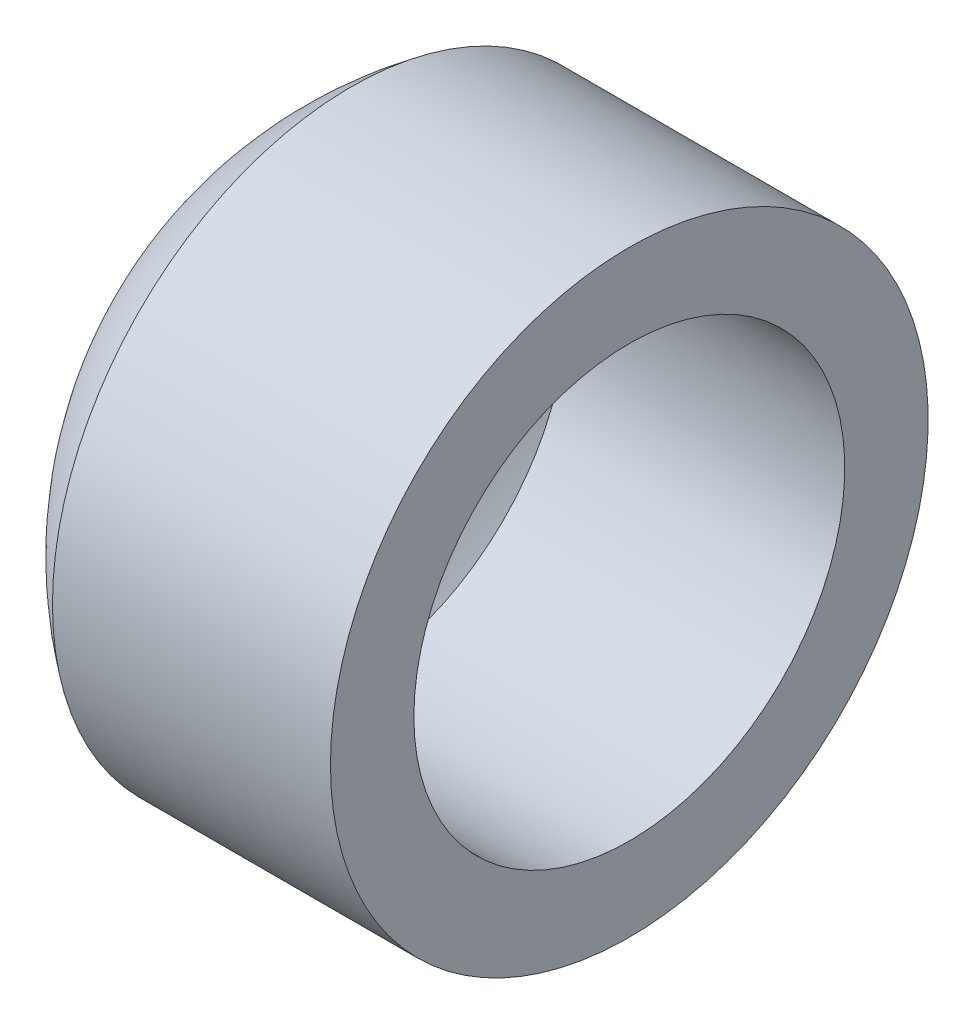
ISO-10303-21;
HEADER;
FILE_DESCRIPTION(('STEP AP214'),'2;1');
FILE_NAME('part.step','',(''),(''),'','','');
FILE_SCHEMA(('AUTOMOTIVE_DESIGN { 1 0 10303 214 1 1 1 1 }'));
ENDSEC;
DATA;
#1=APPLICATION_CONTEXT('core data for automotive mechanical design processes');
#2=APPLICATION_PROTOCOL_DEFINITION('international standard','automotive_design',2000,#1);
#3=PRODUCT_CONTEXT('',#1,'mechanical');
#4=PRODUCT('Part','Part','',(#3));
#5=PRODUCT_RELATED_PRODUCT_CATEGORY('part','',(#4));
#6=PRODUCT_DEFINITION_FORMATION('','',#4);
#7=PRODUCT_DEFINITION_CONTEXT('part definition',#1,'design');
#8=PRODUCT_DEFINITION('design','',#6,#7);
#9=PRODUCT_DEFINITION_SHAPE('','',#8);
#10=(LENGTH_UNIT() NAMED_UNIT(*) SI_UNIT(.MILLI.,.METRE.));
#11=(NAMED_UNIT(*) PLANE_ANGLE_UNIT() SI_UNIT($,.RADIAN.));
#12=(NAMED_UNIT(*) SI_UNIT($,.STERADIAN.) SOLID_ANGLE_UNIT());
#13=UNCERTAINTY_MEASURE_WITH_UNIT(LENGTH_MEASURE(1.E-05),#10,'distance_accuracy_value','');
#14=(GEOMETRIC_REPRESENTATION_CONTEXT(3) GLOBAL_UNCERTAINTY_ASSIGNED_CONTEXT((#13)) GLOBAL_UNIT_ASSIGNED_CONTEXT((#10,
#11,#12)) REPRESENTATION_CONTEXT('',''));
#15=CARTESIAN_POINT('',(0.,0.,0.));
#16=DIRECTION('',(0.,0.,1.));
#17=DIRECTION('',(1.,0.,0.));
#18=AXIS2_PLACEMENT_3D('',#15,#16,#17);
#19=CARTESIAN_POINT('',(-4.4886363636,0.,0.));
#20=DIRECTION('',(-1.,0.,0.));
#21=DIRECTION('',(0.,0.,1.));
#22=AXIS2_PLACEMENT_3D('',#19,#20,#21);
#23=SPHERICAL_SURFACE('',#22,26.5113636364);
#24=CARTESIAN_POINT('',(-20.0000000000258,0.,0.));
#25=DIRECTION('',(1.,0.,0.));
#26=DIRECTION('',(0.,0.,1.));
#27=AXIS2_PLACEMENT_3D('',#24,#25,#26);
#28=CIRCLE('',#27,21.5);
#29=CARTESIAN_POINT('',(-20.,0.,21.5));
#30=VERTEX_POINT('',#29);
#31=EDGE_CURVE('E11',#30,#30,#28,.T.);
#32=ORIENTED_EDGE('',*,*,#31,.F.);
#33=EDGE_LOOP('',(#32));
#34=FACE_BOUND('',#33,.T.);
#35=ADVANCED_FACE('F16',(#34),#23,.T.);
#36=CARTESIAN_POINT('',(0.,0.,0.));
#37=DIRECTION('',(1.,0.,0.));
#38=DIRECTION('',(0.,0.,-1.));
#39=AXIS2_PLACEMENT_3D('',#36,#37,#38);
#40=PLANE('',#39);
#41=CARTESIAN_POINT('',(0.,0.,0.));
#42=DIRECTION('',(1.,0.,0.));
#43=DIRECTION('',(0.,0.,1.));
#44=AXIS2_PLACEMENT_3D('',#41,#42,#43);
#45=CIRCLE('',#44,21.5);
#46=CARTESIAN_POINT('',(0.,0.,21.5));
#47=VERTEX_POINT('',#46);
#48=EDGE_CURVE('E26',#47,#47,#45,.T.);
#49=ORIENTED_EDGE('',*,*,#48,.T.);
#50=EDGE_LOOP('',(#49));
#51=FACE_BOUND('',#50,.T.);
#52=CARTESIAN_POINT('',(0.,0.,0.));
#53=DIRECTION('',(-1.,0.,0.));
#54=DIRECTION('',(0.,0.,1.));
#55=AXIS2_PLACEMENT_3D('',#52,#53,#54);
#56=CIRCLE('',#55,15.5);
#57=CARTESIAN_POINT('',(0.,0.,15.5));
#58=VERTEX_POINT('',#57);
#59=EDGE_CURVE('E40',#58,#58,#56,.T.);
#60=ORIENTED_EDGE('',*,*,#59,.T.);
#61=EDGE_LOOP('',(#60));
#62=FACE_BOUND('',#61,.T.);
#63=ADVANCED_FACE('F41',(#51,#62),#40,.T.);
#64=CARTESIAN_POINT('',(-10.,0.,0.));
#65=DIRECTION('',(1.,0.,0.));
#66=DIRECTION('',(0.,0.,1.));
#67=AXIS2_PLACEMENT_3D('',#64,#65,#66);
#68=CYLINDRICAL_SURFACE('',#67,21.5);
#69=ORIENTED_EDGE('',*,*,#31,.T.);
#70=EDGE_LOOP('',(#69));
#71=FACE_BOUND('',#70,.T.);
#72=ORIENTED_EDGE('',*,*,#48,.F.);
#73=EDGE_LOOP('',(#72));
#74=FACE_BOUND('',#73,.T.);
#75=ADVANCED_FACE('F48',(#71,#74),#68,.T.);
#76=CARTESIAN_POINT('',(1.525,0.,0.));
#77=DIRECTION('',(-1.,0.,0.));
#78=DIRECTION('',(0.,0.,1.));
#79=AXIS2_PLACEMENT_3D('',#76,#77,#78);
#80=SPHERICAL_SURFACE('',#79,26.525);
#81=CARTESIAN_POINT('',(-20.,0.,0.));
#82=DIRECTION('',(1.,0.,0.));
#83=DIRECTION('',(0.,0.,1.));
#84=AXIS2_PLACEMENT_3D('',#81,#82,#83);
#85=CIRCLE('',#84,15.5);
#86=CARTESIAN_POINT('',(-20.,0.,15.5));
#87=VERTEX_POINT('',#86);
#88=EDGE_CURVE('E20',#87,#87,#85,.T.);
#89=ORIENTED_EDGE('',*,*,#88,.T.);
#90=EDGE_LOOP('',(#89));
#91=FACE_BOUND('',#90,.T.);
#92=ADVANCED_FACE('F50',(#91),#80,.F.);
#93=CARTESIAN_POINT('',(-10.,0.,0.));
#94=DIRECTION('',(1.,0.,0.));
#95=DIRECTION('',(0.,0.,1.));
#96=AXIS2_PLACEMENT_3D('',#93,#94,#95);
#97=CYLINDRICAL_SURFACE('',#96,15.5);
#98=ORIENTED_EDGE('',*,*,#88,.F.);
#99=EDGE_LOOP('',(#98));
#100=FACE_BOUND('',#99,.T.);
#101=ORIENTED_EDGE('',*,*,#59,.F.);
#102=EDGE_LOOP('',(#101));
#103=FACE_BOUND('',#102,.T.);
#104=ADVANCED_FACE('F18',(#100,#103),#97,.F.);
#105=CLOSED_SHELL('',(#35,#63,#75,#92,#104));
#106=MANIFOLD_SOLID_BREP('B1',#105);
#107=ADVANCED_BREP_SHAPE_REPRESENTATION('',(#18,#106),#14);
#108=SHAPE_DEFINITION_REPRESENTATION(#9,#107);
ENDSEC;
END-ISO-10303-21;
